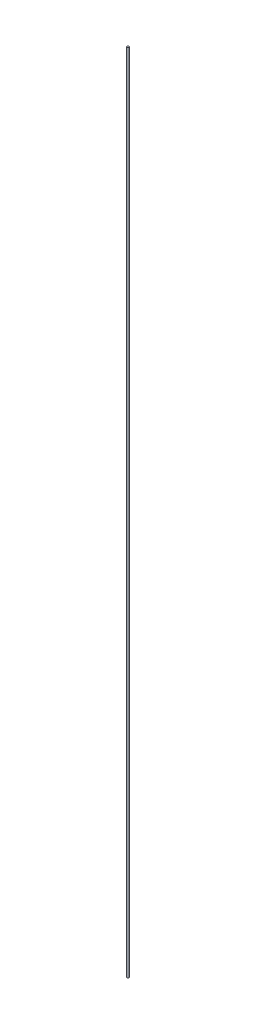
ISO-10303-21;
HEADER;
FILE_DESCRIPTION(('STEP AP214'),'2;1');
FILE_NAME('part.step','',(''),(''),'','','');
FILE_SCHEMA(('AUTOMOTIVE_DESIGN { 1 0 10303 214 1 1 1 1 }'));
ENDSEC;
DATA;
#1=APPLICATION_CONTEXT('core data for automotive mechanical design processes');
#2=APPLICATION_PROTOCOL_DEFINITION('international standard','automotive_design',2000,#1);
#3=PRODUCT_CONTEXT('',#1,'mechanical');
#4=PRODUCT('Part','Part','',(#3));
#5=PRODUCT_RELATED_PRODUCT_CATEGORY('part','',(#4));
#6=PRODUCT_DEFINITION_FORMATION('','',#4);
#7=PRODUCT_DEFINITION_CONTEXT('part definition',#1,'design');
#8=PRODUCT_DEFINITION('design','',#6,#7);
#9=PRODUCT_DEFINITION_SHAPE('','',#8);
#10=(LENGTH_UNIT() NAMED_UNIT(*) SI_UNIT(.MILLI.,.METRE.));
#11=(NAMED_UNIT(*) PLANE_ANGLE_UNIT() SI_UNIT($,.RADIAN.));
#12=(NAMED_UNIT(*) SI_UNIT($,.STERADIAN.) SOLID_ANGLE_UNIT());
#13=UNCERTAINTY_MEASURE_WITH_UNIT(LENGTH_MEASURE(1.E-05),#10,'distance_accuracy_value','');
#14=(GEOMETRIC_REPRESENTATION_CONTEXT(3) GLOBAL_UNCERTAINTY_ASSIGNED_CONTEXT((#13)) GLOBAL_UNIT_ASSIGNED_CONTEXT((#10,
#11,#12)) REPRESENTATION_CONTEXT('',''));
#15=CARTESIAN_POINT('',(0.,0.,0.));
#16=DIRECTION('',(0.,0.,1.));
#17=DIRECTION('',(1.,0.,0.));
#18=AXIS2_PLACEMENT_3D('',#15,#16,#17);
#19=CARTESIAN_POINT('',(-1.11022302462516E-13,990.600000000001,-2.22044604925031E-13));
#20=DIRECTION('',(0.,-1.,0.));
#21=DIRECTION('',(0.,0.,-1.));
#22=AXIS2_PLACEMENT_3D('',#19,#20,#21);
#23=CYLINDRICAL_SURFACE('',#22,1.27);
#24=CARTESIAN_POINT('',(-1.11022302462516E-13,990.600000000001,-2.22044604925031E-13));
#25=DIRECTION('',(0.,1.,0.));
#26=DIRECTION('',(0.,0.,1.));
#27=AXIS2_PLACEMENT_3D('',#24,#25,#26);
#28=CIRCLE('',#27,1.27);
#29=CARTESIAN_POINT('',(-1.10158687727235E-13,990.600000000001,1.26999999999978));
#30=VERTEX_POINT('',#29);
#31=EDGE_CURVE('E10',#30,#30,#28,.T.);
#32=ORIENTED_EDGE('',*,*,#31,.F.);
#33=EDGE_LOOP('',(#32));
#34=FACE_BOUND('',#33,.T.);
#35=CARTESIAN_POINT('',(0.,0.,0.));
#36=DIRECTION('',(0.,1.,0.));
#37=DIRECTION('',(0.,0.,1.));
#38=AXIS2_PLACEMENT_3D('',#35,#36,#37);
#39=CIRCLE('',#38,1.27);
#40=CARTESIAN_POINT('',(0.,0.,1.27));
#41=VERTEX_POINT('',#40);
#42=EDGE_CURVE('E37',#41,#41,#39,.T.);
#43=ORIENTED_EDGE('',*,*,#42,.T.);
#44=EDGE_LOOP('',(#43));
#45=FACE_BOUND('',#44,.T.);
#46=ADVANCED_FACE('F34',(#34,#45),#23,.T.);
#47=CARTESIAN_POINT('',(-1.11022302462516E-13,990.600000000001,-2.22044604925031E-13));
#48=DIRECTION('',(0.,1.,0.));
#49=DIRECTION('',(0.,0.,1.));
#50=AXIS2_PLACEMENT_3D('',#47,#48,#49);
#51=PLANE('',#50);
#52=ORIENTED_EDGE('',*,*,#31,.T.);
#53=EDGE_LOOP('',(#52));
#54=FACE_BOUND('',#53,.T.);
#55=ADVANCED_FACE('F51',(#54),#51,.T.);
#56=CARTESIAN_POINT('',(0.,0.,0.));
#57=DIRECTION('',(0.,1.,0.));
#58=DIRECTION('',(0.,0.,1.));
#59=AXIS2_PLACEMENT_3D('',#56,#57,#58);
#60=PLANE('',#59);
#61=ORIENTED_EDGE('',*,*,#42,.F.);
#62=EDGE_LOOP('',(#61));
#63=FACE_BOUND('',#62,.T.);
#64=ADVANCED_FACE('F49',(#63),#60,.F.);
#65=CLOSED_SHELL('',(#46,#55,#64));
#66=MANIFOLD_SOLID_BREP('B2',#65);
#67=ADVANCED_BREP_SHAPE_REPRESENTATION('',(#18,#66),#14);
#68=SHAPE_DEFINITION_REPRESENTATION(#9,#67);
ENDSEC;
END-ISO-10303-21;
